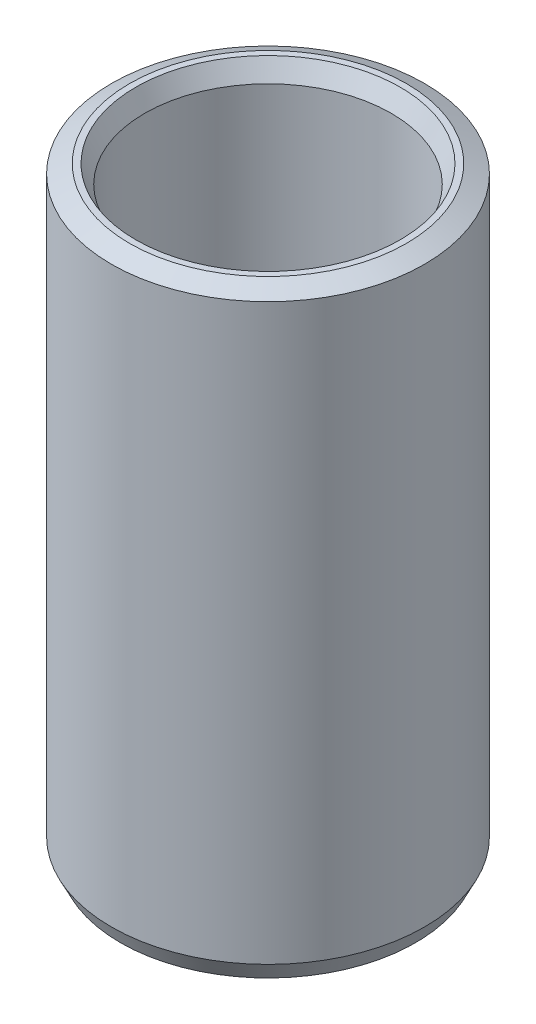
ISO-10303-21;
HEADER;
FILE_DESCRIPTION(('STEP AP214'),'2;1');
FILE_NAME('part.step','',(''),(''),'','','');
FILE_SCHEMA(('AUTOMOTIVE_DESIGN { 1 0 10303 214 1 1 1 1 }'));
ENDSEC;
DATA;
#1=APPLICATION_CONTEXT('core data for automotive mechanical design processes');
#2=APPLICATION_PROTOCOL_DEFINITION('international standard','automotive_design',2000,#1);
#3=PRODUCT_CONTEXT('',#1,'mechanical');
#4=PRODUCT('Part','Part','',(#3));
#5=PRODUCT_RELATED_PRODUCT_CATEGORY('part','',(#4));
#6=PRODUCT_DEFINITION_FORMATION('','',#4);
#7=PRODUCT_DEFINITION_CONTEXT('part definition',#1,'design');
#8=PRODUCT_DEFINITION('design','',#6,#7);
#9=PRODUCT_DEFINITION_SHAPE('','',#8);
#10=(LENGTH_UNIT() NAMED_UNIT(*) SI_UNIT(.MILLI.,.METRE.));
#11=(NAMED_UNIT(*) PLANE_ANGLE_UNIT() SI_UNIT($,.RADIAN.));
#12=(NAMED_UNIT(*) SI_UNIT($,.STERADIAN.) SOLID_ANGLE_UNIT());
#13=UNCERTAINTY_MEASURE_WITH_UNIT(LENGTH_MEASURE(1.E-05),#10,'distance_accuracy_value','');
#14=(GEOMETRIC_REPRESENTATION_CONTEXT(3) GLOBAL_UNCERTAINTY_ASSIGNED_CONTEXT((#13)) GLOBAL_UNIT_ASSIGNED_CONTEXT((#10,
#11,#12)) REPRESENTATION_CONTEXT('',''));
#15=CARTESIAN_POINT('',(0.,0.,0.));
#16=DIRECTION('',(0.,0.,1.));
#17=DIRECTION('',(1.,0.,0.));
#18=AXIS2_PLACEMENT_3D('',#15,#16,#17);
#19=CARTESIAN_POINT('',(0.,220.70376428403,0.));
#20=DIRECTION('',(0.,-1.,0.));
#21=DIRECTION('',(0.,0.,-1.));
#22=AXIS2_PLACEMENT_3D('',#19,#20,#21);
#23=CYLINDRICAL_SURFACE('',#22,57.5);
#24=CARTESIAN_POINT('',(0.,6.65723364518897,0.));
#25=DIRECTION('',(0.,1.,0.));
#26=DIRECTION('',(0.,0.,1.));
#27=AXIS2_PLACEMENT_3D('',#24,#25,#26);
#28=CIRCLE('',#27,57.5);
#29=CARTESIAN_POINT('',(0.,6.65723364518894,-57.5));
#30=VERTEX_POINT('',#29);
#31=EDGE_CURVE('E10',#30,#30,#28,.T.);
#32=CARTESIAN_POINT('',(0.,217.407283477707,0.));
#33=DIRECTION('',(0.,1.,0.));
#34=DIRECTION('',(0.,0.,1.));
#35=AXIS2_PLACEMENT_3D('',#32,#33,#34);
#36=CIRCLE('',#35,57.5);
#37=CARTESIAN_POINT('',(0.,217.407283477707,-57.5));
#38=VERTEX_POINT('',#37);
#39=EDGE_CURVE('E50',#38,#38,#36,.F.);
#40=CARTESIAN_POINT('',(0.,6.65723364518894,-57.5));
#41=CARTESIAN_POINT('',(0.,8.85254666427767,-57.5));
#42=CARTESIAN_POINT('',(0.,11.0478596833664,-57.5));
#43=CARTESIAN_POINT('',(0.,15.4384857215439,-57.5));
#44=CARTESIAN_POINT('',(0.,17.6337987406326,-57.5));
#45=CARTESIAN_POINT('',(0.,22.0244247788101,-57.5));
#46=CARTESIAN_POINT('',(0.,24.2197377978988,-57.5));
#47=CARTESIAN_POINT('',(0.,28.6103638360763,-57.5));
#48=CARTESIAN_POINT('',(0.,30.805676855165,-57.5));
#49=CARTESIAN_POINT('',(0.,35.1963028933424,-57.5));
#50=CARTESIAN_POINT('',(0.,37.3916159124312,-57.5));
#51=CARTESIAN_POINT('',(0.,41.7822419506086,-57.5));
#52=CARTESIAN_POINT('',(0.,43.9775549696974,-57.5));
#53=CARTESIAN_POINT('',(0.,48.3681810078748,-57.5));
#54=CARTESIAN_POINT('',(0.,50.5634940269636,-57.5));
#55=CARTESIAN_POINT('',(0.,54.954120065141,-57.5));
#56=CARTESIAN_POINT('',(0.,57.1494330842297,-57.5));
#57=CARTESIAN_POINT('',(0.,61.5400591224072,-57.5));
#58=CARTESIAN_POINT('',(0.,63.7353721414959,-57.5));
#59=CARTESIAN_POINT('',(0.,68.1259981796734,-57.5));
#60=CARTESIAN_POINT('',(0.,70.3213111987621,-57.5));
#61=CARTESIAN_POINT('',(0.,74.7119372369396,-57.5));
#62=CARTESIAN_POINT('',(0.,76.9072502560283,-57.5));
#63=CARTESIAN_POINT('',(0.,81.2978762942058,-57.5));
#64=CARTESIAN_POINT('',(0.,83.4931893132945,-57.5));
#65=CARTESIAN_POINT('',(0.,87.883815351472,-57.5));
#66=CARTESIAN_POINT('',(0.,90.0791283705607,-57.5));
#67=CARTESIAN_POINT('',(0.,94.4697544087381,-57.5));
#68=CARTESIAN_POINT('',(0.,96.6650674278269,-57.5));
#69=CARTESIAN_POINT('',(0.,101.055693466004,-57.5));
#70=CARTESIAN_POINT('',(0.,103.251006485093,-57.5));
#71=CARTESIAN_POINT('',(0.,107.641632523271,-57.5));
#72=CARTESIAN_POINT('',(0.,109.836945542359,-57.5));
#73=CARTESIAN_POINT('',(0.,114.227571580537,-57.5));
#74=CARTESIAN_POINT('',(0.,116.422884599625,-57.5));
#75=CARTESIAN_POINT('',(0.,120.813510637803,-57.5));
#76=CARTESIAN_POINT('',(0.,123.008823656892,-57.5));
#77=CARTESIAN_POINT('',(0.,127.399449695069,-57.5));
#78=CARTESIAN_POINT('',(0.,129.594762714158,-57.5));
#79=CARTESIAN_POINT('',(0.,133.985388752335,-57.5));
#80=CARTESIAN_POINT('',(0.,136.180701771424,-57.5));
#81=CARTESIAN_POINT('',(0.,140.571327809601,-57.5));
#82=CARTESIAN_POINT('',(0.,142.76664082869,-57.5));
#83=CARTESIAN_POINT('',(0.,147.157266866868,-57.5));
#84=CARTESIAN_POINT('',(0.,149.352579885956,-57.5));
#85=CARTESIAN_POINT('',(0.,153.743205924134,-57.5));
#86=CARTESIAN_POINT('',(0.,155.938518943223,-57.5));
#87=CARTESIAN_POINT('',(0.,160.3291449814,-57.5));
#88=CARTESIAN_POINT('',(0.,162.524458000489,-57.5));
#89=CARTESIAN_POINT('',(0.,166.915084038666,-57.5));
#90=CARTESIAN_POINT('',(0.,169.110397057755,-57.5));
#91=CARTESIAN_POINT('',(0.,173.501023095932,-57.5));
#92=CARTESIAN_POINT('',(0.,175.696336115021,-57.5));
#93=CARTESIAN_POINT('',(0.,180.086962153199,-57.5));
#94=CARTESIAN_POINT('',(0.,182.282275172287,-57.5));
#95=CARTESIAN_POINT('',(0.,186.672901210465,-57.5));
#96=CARTESIAN_POINT('',(0.,188.868214229554,-57.5));
#97=CARTESIAN_POINT('',(0.,193.258840267731,-57.5));
#98=CARTESIAN_POINT('',(0.,195.45415328682,-57.5));
#99=CARTESIAN_POINT('',(0.,199.844779324997,-57.5));
#100=CARTESIAN_POINT('',(0.,202.040092344086,-57.5));
#101=CARTESIAN_POINT('',(0.,206.430718382263,-57.5));
#102=CARTESIAN_POINT('',(0.,208.626031401352,-57.5));
#103=CARTESIAN_POINT('',(0.,213.01665743953,-57.5));
#104=CARTESIAN_POINT('',(0.,215.211970458618,-57.5));
#105=CARTESIAN_POINT('',(0.,217.407283477707,-57.5));
#106=B_SPLINE_CURVE_WITH_KNOTS('',3,(#40,#41,#42,#43,#44,#45,#46,#47,#48,#49,#50,#51,#52,#53,
#54,#55,#56,#57,#58,#59,#60,#61,#62,#63,#64,#65,#66,#67,#68,#69,#70,#71,#72,#73,#74,#75,#76,#77,
#78,#79,#80,#81,#82,#83,#84,#85,#86,#87,#88,#89,#90,#91,#92,#93,#94,#95,#96,#97,#98,#99,#100,
#101,#102,#103,#104,#105),.UNSPECIFIED.,.F.,.F.,(4,2,2,2,2,2,2,2,2,2,2,2,2,2,2,2,2,2,2,2,2,2,2,
2,2,2,2,2,2,2,2,2,4),(0.,6.58593905726618,13.1718781145324,19.7578171717986,26.3437562290648,
32.9296952863309,39.5156343435971,46.1015734008634,52.6875124581295,59.2734515153957,
65.8593905726619,72.4453296299281,79.0312686871943,85.6172077444605,92.2031468017267,
98.7890858589928,105.375024916259,111.960963973525,118.546903030791,125.132842088058,
131.718781145324,138.30472020259,144.890659259856,151.476598317122,158.062537374389,
164.648476431655,171.234415488921,177.820354546187,184.406293603453,190.992232660719,
197.578171717986,204.164110775252,210.750049832518),.UNSPECIFIED.);
#107=EDGE_CURVE('BSEAM39',#30,#38,#106,.T.);
#108=ORIENTED_EDGE('',*,*,#31,.T.);
#109=ORIENTED_EDGE('',*,*,#39,.T.);
#110=ORIENTED_EDGE('',*,*,#107,.T.);
#111=ORIENTED_EDGE('',*,*,#107,.F.);
#112=EDGE_LOOP('',(#108,#110,#109,#111));
#113=FACE_BOUND('',#112,.T.);
#114=ADVANCED_FACE('F39',(#113),#23,.T.);
#115=CARTESIAN_POINT('',(0.,220.70376428403,0.));
#116=DIRECTION('',(0.,1.,0.));
#117=DIRECTION('',(0.,0.,1.));
#118=AXIS2_PLACEMENT_3D('',#115,#116,#117);
#119=PLANE('',#118);
#120=CARTESIAN_POINT('',(0.,220.70376428403,0.));
#121=DIRECTION('',(0.,1.,0.));
#122=DIRECTION('',(0.,0.,1.));
#123=AXIS2_PLACEMENT_3D('',#120,#121,#122);
#124=CIRCLE('',#123,48.5578452740064);
#125=CARTESIAN_POINT('',(0.,220.70376428403,48.5578452740064));
#126=VERTEX_POINT('',#125);
#127=EDGE_CURVE('E58',#126,#126,#124,.F.);
#128=ORIENTED_EDGE('',*,*,#127,.T.);
#129=EDGE_LOOP('',(#128));
#130=FACE_BOUND('',#129,.T.);
#131=CARTESIAN_POINT('',(0.,220.70376428403,0.));
#132=DIRECTION('',(0.,1.,0.));
#133=DIRECTION('',(0.,0.,1.));
#134=AXIS2_PLACEMENT_3D('',#131,#132,#133);
#135=CIRCLE('',#134,50.8427663548114);
#136=CARTESIAN_POINT('',(0.,220.70376428403,-50.8427663548114));
#137=VERTEX_POINT('',#136);
#138=EDGE_CURVE('E61',#137,#137,#135,.T.);
#139=ORIENTED_EDGE('',*,*,#138,.T.);
#140=EDGE_LOOP('',(#139));
#141=FACE_BOUND('',#140,.T.);
#142=ADVANCED_FACE('F88',(#130,#141),#119,.T.);
#143=CARTESIAN_POINT('',(0.,0.,0.));
#144=DIRECTION('',(0.,1.,0.));
#145=DIRECTION('',(0.,0.,1.));
#146=AXIS2_PLACEMENT_3D('',#143,#144,#145);
#147=PLANE('',#146);
#148=CARTESIAN_POINT('',(0.,0.,0.));
#149=DIRECTION('',(0.,1.,0.));
#150=DIRECTION('',(0.,0.,1.));
#151=AXIS2_PLACEMENT_3D('',#148,#149,#150);
#152=CIRCLE('',#151,51.9185981128713);
#153=CARTESIAN_POINT('',(0.,0.,-51.9185981128713));
#154=VERTEX_POINT('',#153);
#155=EDGE_CURVE('E51',#154,#154,#152,.T.);
#156=ORIENTED_EDGE('',*,*,#155,.T.);
#157=EDGE_LOOP('',(#156));
#158=FACE_BOUND('',#157,.T.);
#159=CARTESIAN_POINT('',(0.,0.,0.));
#160=DIRECTION('',(0.,1.,0.));
#161=DIRECTION('',(0.,0.,1.));
#162=AXIS2_PLACEMENT_3D('',#159,#160,#161);
#163=CIRCLE('',#162,54.2035191936764);
#164=CARTESIAN_POINT('',(0.,0.,54.2035191936764));
#165=VERTEX_POINT('',#164);
#166=EDGE_CURVE('E54',#165,#165,#163,.F.);
#167=ORIENTED_EDGE('',*,*,#166,.T.);
#168=EDGE_LOOP('',(#167));
#169=FACE_BOUND('',#168,.T.);
#170=ADVANCED_FACE('F83',(#158,#169),#147,.F.);
#171=CARTESIAN_POINT('',(0.,220.70376428403,0.));
#172=DIRECTION('',(0.,-1.,0.));
#173=DIRECTION('',(0.,0.,-1.));
#174=AXIS2_PLACEMENT_3D('',#171,#172,#173);
#175=CYLINDRICAL_SURFACE('',#174,45.2613644676828);
#176=CARTESIAN_POINT('',(0.,214.046530638841,0.));
#177=DIRECTION('',(0.,1.,0.));
#178=DIRECTION('',(0.,0.,1.));
#179=AXIS2_PLACEMENT_3D('',#176,#177,#178);
#180=CIRCLE('',#179,45.2613644676828);
#181=CARTESIAN_POINT('',(0.,214.046530638841,-45.2613644676828));
#182=VERTEX_POINT('',#181);
#183=EDGE_CURVE('E67',#182,#182,#180,.T.);
#184=CARTESIAN_POINT('',(0.,3.29648080632339,0.));
#185=DIRECTION('',(0.,1.,0.));
#186=DIRECTION('',(0.,0.,1.));
#187=AXIS2_PLACEMENT_3D('',#184,#185,#186);
#188=CIRCLE('',#187,45.2613644676828);
#189=CARTESIAN_POINT('',(0.,3.29648080632339,-45.2613644676828));
#190=VERTEX_POINT('',#189);
#191=EDGE_CURVE('E69',#190,#190,#188,.F.);
#192=CARTESIAN_POINT('',(0.,214.046530638841,-45.2613644676828));
#193=CARTESIAN_POINT('',(0.,211.851217619753,-45.2613644676828));
#194=CARTESIAN_POINT('',(0.,209.655904600664,-45.2613644676828));
#195=CARTESIAN_POINT('',(0.,205.265278562487,-45.2613644676828));
#196=CARTESIAN_POINT('',(0.,203.069965543398,-45.2613644676828));
#197=CARTESIAN_POINT('',(0.,198.67933950522,-45.2613644676828));
#198=CARTESIAN_POINT('',(0.,196.484026486132,-45.2613644676828));
#199=CARTESIAN_POINT('',(0.,192.093400447954,-45.2613644676828));
#200=CARTESIAN_POINT('',(0.,189.898087428865,-45.2613644676828));
#201=CARTESIAN_POINT('',(0.,185.507461390688,-45.2613644676828));
#202=CARTESIAN_POINT('',(0.,183.312148371599,-45.2613644676828));
#203=CARTESIAN_POINT('',(0.,178.921522333422,-45.2613644676828));
#204=CARTESIAN_POINT('',(0.,176.726209314333,-45.2613644676828));
#205=CARTESIAN_POINT('',(0.,172.335583276156,-45.2613644676828));
#206=CARTESIAN_POINT('',(0.,170.140270257067,-45.2613644676828));
#207=CARTESIAN_POINT('',(0.,165.749644218889,-45.2613644676828));
#208=CARTESIAN_POINT('',(0.,163.554331199801,-45.2613644676828));
#209=CARTESIAN_POINT('',(0.,159.163705161623,-45.2613644676828));
#210=CARTESIAN_POINT('',(0.,156.968392142535,-45.2613644676828));
#211=CARTESIAN_POINT('',(0.,152.577766104357,-45.2613644676828));
#212=CARTESIAN_POINT('',(0.,150.382453085268,-45.2613644676828));
#213=CARTESIAN_POINT('',(0.,145.991827047091,-45.2613644676828));
#214=CARTESIAN_POINT('',(0.,143.796514028002,-45.2613644676828));
#215=CARTESIAN_POINT('',(0.,139.405887989825,-45.2613644676828));
#216=CARTESIAN_POINT('',(0.,137.210574970736,-45.2613644676828));
#217=CARTESIAN_POINT('',(0.,132.819948932558,-45.2613644676828));
#218=CARTESIAN_POINT('',(0.,130.62463591347,-45.2613644676828));
#219=CARTESIAN_POINT('',(0.,126.234009875292,-45.2613644676828));
#220=CARTESIAN_POINT('',(0.,124.038696856204,-45.2613644676828));
#221=CARTESIAN_POINT('',(0.,119.648070818026,-45.2613644676828));
#222=CARTESIAN_POINT('',(0.,117.452757798937,-45.2613644676828));
#223=CARTESIAN_POINT('',(0.,113.06213176076,-45.2613644676828));
#224=CARTESIAN_POINT('',(0.,110.866818741671,-45.2613644676828));
#225=CARTESIAN_POINT('',(0.,106.476192703494,-45.2613644676828));
#226=CARTESIAN_POINT('',(0.,104.280879684405,-45.2613644676828));
#227=CARTESIAN_POINT('',(0.,99.8902536462275,-45.2613644676828));
#228=CARTESIAN_POINT('',(0.,97.6949406271388,-45.2613644676828));
#229=CARTESIAN_POINT('',(0.,93.3043145889613,-45.2613644676828));
#230=CARTESIAN_POINT('',(0.,91.1090015698726,-45.2613644676828));
#231=CARTESIAN_POINT('',(0.,86.7183755316951,-45.2613644676828));
#232=CARTESIAN_POINT('',(0.,84.5230625126064,-45.2613644676828));
#233=CARTESIAN_POINT('',(0.,80.132436474429,-45.2613644676828));
#234=CARTESIAN_POINT('',(0.,77.9371234553402,-45.2613644676828));
#235=CARTESIAN_POINT('',(0.,73.5464974171628,-45.2613644676828));
#236=CARTESIAN_POINT('',(0.,71.351184398074,-45.2613644676828));
#237=CARTESIAN_POINT('',(0.,66.9605583598966,-45.2613644676828));
#238=CARTESIAN_POINT('',(0.,64.7652453408078,-45.2613644676828));
#239=CARTESIAN_POINT('',(0.,60.3746193026304,-45.2613644676828));
#240=CARTESIAN_POINT('',(0.,58.1793062835416,-45.2613644676828));
#241=CARTESIAN_POINT('',(0.,53.7886802453642,-45.2613644676828));
#242=CARTESIAN_POINT('',(0.,51.5933672262755,-45.2613644676828));
#243=CARTESIAN_POINT('',(0.,47.202741188098,-45.2613644676828));
#244=CARTESIAN_POINT('',(0.,45.0074281690093,-45.2613644676828));
#245=CARTESIAN_POINT('',(0.,40.6168021308318,-45.2613644676828));
#246=CARTESIAN_POINT('',(0.,38.4214891117431,-45.2613644676828));
#247=CARTESIAN_POINT('',(0.,34.0308630735656,-45.2613644676828));
#248=CARTESIAN_POINT('',(0.,31.8355500544769,-45.2613644676828));
#249=CARTESIAN_POINT('',(0.,27.4449240162994,-45.2613644676828));
#250=CARTESIAN_POINT('',(0.,25.2496109972107,-45.2613644676828));
#251=CARTESIAN_POINT('',(0.,20.8589849590332,-45.2613644676828));
#252=CARTESIAN_POINT('',(0.,18.6636719399445,-45.2613644676828));
#253=CARTESIAN_POINT('',(0.,14.273045901767,-45.2613644676828));
#254=CARTESIAN_POINT('',(0.,12.0777328826783,-45.2613644676828));
#255=CARTESIAN_POINT('',(0.,7.68710684450084,-45.2613644676828));
#256=CARTESIAN_POINT('',(0.,5.49179382541211,-45.2613644676828));
#257=CARTESIAN_POINT('',(0.,3.29648080632339,-45.2613644676828));
#258=B_SPLINE_CURVE_WITH_KNOTS('',3,(#192,#193,#194,#195,#196,#197,#198,#199,#200,#201,#202,
#203,#204,#205,#206,#207,#208,#209,#210,#211,#212,#213,#214,#215,#216,#217,#218,#219,#220,#221,
#222,#223,#224,#225,#226,#227,#228,#229,#230,#231,#232,#233,#234,#235,#236,#237,#238,#239,#240,
#241,#242,#243,#244,#245,#246,#247,#248,#249,#250,#251,#252,#253,#254,#255,#256,#257),
.UNSPECIFIED.,.F.,.F.,(4,2,2,2,2,2,2,2,2,2,2,2,2,2,2,2,2,2,2,2,2,2,2,2,2,2,2,2,2,2,2,2,4),(0.,
6.58593905726618,13.1718781145324,19.7578171717986,26.3437562290647,32.9296952863309,
39.5156343435971,46.1015734008633,52.6875124581295,59.2734515153957,65.8593905726619,
72.4453296299281,79.0312686871943,85.6172077444604,92.2031468017266,98.7890858589928,
105.375024916259,111.960963973525,118.546903030791,125.132842088058,131.718781145324,
138.30472020259,144.890659259856,151.476598317122,158.062537374389,164.648476431655,
171.234415488921,177.820354546187,184.406293603453,190.992232660719,197.578171717986,
204.164110775252,210.750049832518),.UNSPECIFIED.);
#259=EDGE_CURVE('BSEAM71',#182,#190,#258,.T.);
#260=ORIENTED_EDGE('',*,*,#183,.T.);
#261=ORIENTED_EDGE('',*,*,#191,.T.);
#262=ORIENTED_EDGE('',*,*,#259,.T.);
#263=ORIENTED_EDGE('',*,*,#259,.F.);
#264=EDGE_LOOP('',(#260,#262,#261,#263));
#265=FACE_BOUND('',#264,.T.);
#266=ADVANCED_FACE('F71',(#265),#175,.F.);
#267=CARTESIAN_POINT('',(0.,214.046530638841,0.));
#268=DIRECTION('',(0.,1.,0.));
#269=DIRECTION('',(0.,0.,1.));
#270=AXIS2_PLACEMENT_3D('',#267,#268,#269);
#271=CONICAL_SURFACE('',#270,45.2613644676828,0.459778370988112);
#272=ORIENTED_EDGE('',*,*,#127,.F.);
#273=EDGE_LOOP('',(#272));
#274=FACE_BOUND('',#273,.T.);
#275=ORIENTED_EDGE('',*,*,#183,.F.);
#276=EDGE_LOOP('',(#275));
#277=FACE_BOUND('',#276,.T.);
#278=ADVANCED_FACE('F77',(#274,#277),#271,.F.);
#279=CARTESIAN_POINT('',(0.,0.,0.));
#280=DIRECTION('',(0.,-1.,0.));
#281=DIRECTION('',(0.,0.,-1.));
#282=AXIS2_PLACEMENT_3D('',#279,#280,#281);
#283=CONICAL_SURFACE('',#282,51.9185981128713,1.11101795580677);
#284=CARTESIAN_POINT('',(0.,3.29648080632339,-45.2613644676828));
#285=CARTESIAN_POINT('',(0.,3.26214246459085,-45.3307106514869));
#286=CARTESIAN_POINT('',(0.,3.22780412285832,-45.4000568352909));
#287=CARTESIAN_POINT('',(0.,3.15912743939325,-45.538749202899));
#288=CARTESIAN_POINT('',(0.,3.12478909766071,-45.6080953867031));
#289=CARTESIAN_POINT('',(0.,3.05611241419564,-45.7467877543112));
#290=CARTESIAN_POINT('',(0.,3.02177407246311,-45.8161339381152));
#291=CARTESIAN_POINT('',(0.,2.95309738899803,-45.9548263057233));
#292=CARTESIAN_POINT('',(0.,2.9187590472655,-46.0241724895273));
#293=CARTESIAN_POINT('',(0.,2.85008236380043,-46.1628648571354));
#294=CARTESIAN_POINT('',(0.,2.81574402206789,-46.2322110409395));
#295=CARTESIAN_POINT('',(0.,2.74706733860282,-46.3709034085476));
#296=CARTESIAN_POINT('',(0.,2.71272899687029,-46.4402495923516));
#297=CARTESIAN_POINT('',(0.,2.64405231340522,-46.5789419599597));
#298=CARTESIAN_POINT('',(0.,2.60971397167268,-46.6482881437638));
#299=CARTESIAN_POINT('',(0.,2.54103728820761,-46.7869805113719));
#300=CARTESIAN_POINT('',(0.,2.50669894647508,-46.8563266951759));
#301=CARTESIAN_POINT('',(0.,2.43802226301,-46.995019062784));
#302=CARTESIAN_POINT('',(0.,2.40368392127747,-47.064365246588));
#303=CARTESIAN_POINT('',(0.,2.3350072378124,-47.2030576141961));
#304=CARTESIAN_POINT('',(0.,2.30066889607986,-47.2724037980002));
#305=CARTESIAN_POINT('',(0.,2.23199221261479,-47.4110961656083));
#306=CARTESIAN_POINT('',(0.,2.19765387088226,-47.4804423494123));
#307=CARTESIAN_POINT('',(0.,2.12897718741719,-47.6191347170204));
#308=CARTESIAN_POINT('',(0.,2.09463884568465,-47.6884809008245));
#309=CARTESIAN_POINT('',(0.,2.02596216221958,-47.8271732684326));
#310=CARTESIAN_POINT('',(0.,1.99162382048705,-47.8965194522366));
#311=CARTESIAN_POINT('',(0.,1.92294713702198,-48.0352118198447));
#312=CARTESIAN_POINT('',(0.,1.88860879528944,-48.1045580036487));
#313=CARTESIAN_POINT('',(0.,1.81993211182437,-48.2432503712568));
#314=CARTESIAN_POINT('',(0.,1.78559377009183,-48.3125965550609));
#315=CARTESIAN_POINT('',(0.,1.71691708662676,-48.451288922669));
#316=CARTESIAN_POINT('',(0.,1.68257874489423,-48.520635106473));
#317=CARTESIAN_POINT('',(0.,1.61390206142916,-48.6593274740811));
#318=CARTESIAN_POINT('',(0.,1.57956371969662,-48.7286736578852));
#319=CARTESIAN_POINT('',(0.,1.51088703623155,-48.8673660254933));
#320=CARTESIAN_POINT('',(0.,1.47654869449902,-48.9367122092973));
#321=CARTESIAN_POINT('',(0.,1.40787201103395,-49.0754045769054));
#322=CARTESIAN_POINT('',(0.,1.37353366930141,-49.1447507607095));
#323=CARTESIAN_POINT('',(0.,1.30485698583634,-49.2834431283176));
#324=CARTESIAN_POINT('',(0.,1.27051864410381,-49.3527893121216));
#325=CARTESIAN_POINT('',(0.,1.20184196063873,-49.4914816797297));
#326=CARTESIAN_POINT('',(0.,1.1675036189062,-49.5608278635337));
#327=CARTESIAN_POINT('',(0.,1.09882693544113,-49.6995202311418));
#328=CARTESIAN_POINT('',(0.,1.06448859370859,-49.7688664149459));
#329=CARTESIAN_POINT('',(0.,0.995811910243523,-49.907558782554));
#330=CARTESIAN_POINT('',(0.,0.961473568510988,-49.976904966358));
#331=CARTESIAN_POINT('',(0.,0.892796885045918,-50.1155973339661));
#332=CARTESIAN_POINT('',(0.,0.858458543313382,-50.1849435177702));
#333=CARTESIAN_POINT('',(0.,0.789781859848311,-50.3236358853783));
#334=CARTESIAN_POINT('',(0.,0.755443518115776,-50.3929820691823));
#335=CARTESIAN_POINT('',(0.,0.686766834650705,-50.5316744367904));
#336=CARTESIAN_POINT('',(0.,0.652428492918171,-50.6010206205944));
#337=CARTESIAN_POINT('',(0.,0.5837518094531,-50.7397129882025));
#338=CARTESIAN_POINT('',(0.,0.549413467720565,-50.8090591720066));
#339=CARTESIAN_POINT('',(0.,0.480736784255494,-50.9477515396147));
#340=CARTESIAN_POINT('',(0.,0.446398442522959,-51.0170977234187));
#341=CARTESIAN_POINT('',(0.,0.377721759057888,-51.1557900910268));
#342=CARTESIAN_POINT('',(0.,0.343383417325353,-51.2251362748309));
#343=CARTESIAN_POINT('',(0.,0.274706733860282,-51.3638286424389));
#344=CARTESIAN_POINT('',(0.,0.240368392127746,-51.433174826243));
#345=CARTESIAN_POINT('',(0.,0.171691708662676,-51.5718671938511));
#346=CARTESIAN_POINT('',(0.,0.137353366930141,-51.6412133776551));
#347=CARTESIAN_POINT('',(0.,0.0686766834650715,-51.7799057452632));
#348=CARTESIAN_POINT('',(0.,0.0343383417325367,-51.8492519290673));
#349=CARTESIAN_POINT('',(0.,0.,-51.9185981128713));
#350=B_SPLINE_CURVE_WITH_KNOTS('',3,(#284,#285,#286,#287,#288,#289,#290,#291,#292,#293,#294,
#295,#296,#297,#298,#299,#300,#301,#302,#303,#304,#305,#306,#307,#308,#309,#310,#311,#312,#313,
#314,#315,#316,#317,#318,#319,#320,#321,#322,#323,#324,#325,#326,#327,#328,#329,#330,#331,#332,
#333,#334,#335,#336,#337,#338,#339,#340,#341,#342,#343,#344,#345,#346,#347,#348,#349),
.UNSPECIFIED.,.F.,.F.,(4,2,2,2,2,2,2,2,2,2,2,2,2,2,2,2,2,2,2,2,2,2,2,2,2,2,2,2,2,2,2,2,4),(0.,
0.23214679470138,0.464293589402765,0.696440384104145,0.928587178805525,1.1607339735069,
1.39288076820828,1.62502756290967,1.85717435761105,2.08932115231243,2.32146794701382,
2.5536147417152,2.78576153641657,3.01790833111795,3.25005512581933,3.48220192052072,
3.7143487152221,3.94649550992348,4.17864230462486,4.41078909932624,4.64293589402762,
4.875082688729,5.10722948343038,5.33937627813177,5.57152307283315,5.80366986753453,
6.03581666223591,6.26796345693729,6.50011025163867,6.73225704634005,6.96440384104143,
7.19655063574282,7.4286974304442),.UNSPECIFIED.);
#351=EDGE_CURVE('BSEAM73',#190,#154,#350,.T.);
#352=ORIENTED_EDGE('',*,*,#191,.F.);
#353=ORIENTED_EDGE('',*,*,#155,.F.);
#354=ORIENTED_EDGE('',*,*,#351,.T.);
#355=ORIENTED_EDGE('',*,*,#351,.F.);
#356=EDGE_LOOP('',(#352,#354,#353,#355));
#357=FACE_BOUND('',#356,.T.);
#358=ADVANCED_FACE('F73',(#357),#283,.F.);
#359=CARTESIAN_POINT('',(0.,6.65723364518897,0.));
#360=DIRECTION('',(0.,1.,0.));
#361=DIRECTION('',(0.,0.,1.));
#362=AXIS2_PLACEMENT_3D('',#359,#360,#361);
#363=CONICAL_SURFACE('',#362,57.5,0.459778370988119);
#364=ORIENTED_EDGE('',*,*,#166,.F.);
#365=EDGE_LOOP('',(#364));
#366=FACE_BOUND('',#365,.T.);
#367=ORIENTED_EDGE('',*,*,#31,.F.);
#368=EDGE_LOOP('',(#367));
#369=FACE_BOUND('',#368,.T.);
#370=ADVANCED_FACE('F76',(#366,#369),#363,.T.);
#371=CARTESIAN_POINT('',(0.,220.70376428403,0.));
#372=DIRECTION('',(0.,-1.,0.));
#373=DIRECTION('',(0.,0.,-1.));
#374=AXIS2_PLACEMENT_3D('',#371,#372,#373);
#375=CONICAL_SURFACE('',#374,50.8427663548114,1.11101795580678);
#376=CARTESIAN_POINT('',(0.,217.407283477707,-57.5));
#377=CARTESIAN_POINT('',(0.,217.44162181944,-57.430653816196));
#378=CARTESIAN_POINT('',(0.,217.475960161172,-57.3613076323919));
#379=CARTESIAN_POINT('',(0.,217.544636844637,-57.2226152647838));
#380=CARTESIAN_POINT('',(0.,217.57897518637,-57.1532690809798));
#381=CARTESIAN_POINT('',(0.,217.647651869835,-57.0145767133717));
#382=CARTESIAN_POINT('',(0.,217.681990211567,-56.9452305295676));
#383=CARTESIAN_POINT('',(0.,217.750666895032,-56.8065381619596));
#384=CARTESIAN_POINT('',(0.,217.785005236765,-56.7371919781555));
#385=CARTESIAN_POINT('',(0.,217.85368192023,-56.5984996105474));
#386=CARTESIAN_POINT('',(0.,217.888020261963,-56.5291534267434));
#387=CARTESIAN_POINT('',(0.,217.956696945428,-56.3904610591353));
#388=CARTESIAN_POINT('',(0.,217.99103528716,-56.3211148753312));
#389=CARTESIAN_POINT('',(0.,218.059711970625,-56.1824225077231));
#390=CARTESIAN_POINT('',(0.,218.094050312358,-56.1130763239191));
#391=CARTESIAN_POINT('',(0.,218.162726995823,-55.974383956311));
#392=CARTESIAN_POINT('',(0.,218.197065337555,-55.9050377725069));
#393=CARTESIAN_POINT('',(0.,218.26574202102,-55.7663454048988));
#394=CARTESIAN_POINT('',(0.,218.300080362753,-55.6969992210948));
#395=CARTESIAN_POINT('',(0.,218.368757046218,-55.5583068534867));
#396=CARTESIAN_POINT('',(0.,218.403095387951,-55.4889606696826));
#397=CARTESIAN_POINT('',(0.,218.471772071416,-55.3502683020745));
#398=CARTESIAN_POINT('',(0.,218.506110413148,-55.2809221182705));
#399=CARTESIAN_POINT('',(0.,218.574787096613,-55.1422297506624));
#400=CARTESIAN_POINT('',(0.,218.609125438346,-55.0728835668583));
#401=CARTESIAN_POINT('',(0.,218.677802121811,-54.9341911992503));
#402=CARTESIAN_POINT('',(0.,218.712140463543,-54.8648450154462));
#403=CARTESIAN_POINT('',(0.,218.780817147008,-54.7261526478381));
#404=CARTESIAN_POINT('',(0.,218.815155488741,-54.6568064640341));
#405=CARTESIAN_POINT('',(0.,218.883832172206,-54.518114096426));
#406=CARTESIAN_POINT('',(0.,218.918170513939,-54.4487679126219));
#407=CARTESIAN_POINT('',(0.,218.986847197404,-54.3100755450138));
#408=CARTESIAN_POINT('',(0.,219.021185539136,-54.2407293612098));
#409=CARTESIAN_POINT('',(0.,219.089862222601,-54.1020369936017));
#410=CARTESIAN_POINT('',(0.,219.124200564334,-54.0326908097976));
#411=CARTESIAN_POINT('',(0.,219.192877247799,-53.8939984421895));
#412=CARTESIAN_POINT('',(0.,219.227215589531,-53.8246522583855));
#413=CARTESIAN_POINT('',(0.,219.295892272996,-53.6859598907774));
#414=CARTESIAN_POINT('',(0.,219.330230614729,-53.6166137069733));
#415=CARTESIAN_POINT('',(0.,219.398907298194,-53.4779213393652));
#416=CARTESIAN_POINT('',(0.,219.433245639927,-53.4085751555612));
#417=CARTESIAN_POINT('',(0.,219.501922323392,-53.2698827879531));
#418=CARTESIAN_POINT('',(0.,219.536260665124,-53.200536604149));
#419=CARTESIAN_POINT('',(0.,219.604937348589,-53.0618442365409));
#420=CARTESIAN_POINT('',(0.,219.639275690322,-52.9924980527369));
#421=CARTESIAN_POINT('',(0.,219.707952373787,-52.8538056851288));
#422=CARTESIAN_POINT('',(0.,219.742290715519,-52.7844595013248));
#423=CARTESIAN_POINT('',(0.,219.810967398985,-52.6457671337167));
#424=CARTESIAN_POINT('',(0.,219.845305740717,-52.5764209499126));
#425=CARTESIAN_POINT('',(0.,219.913982424182,-52.4377285823045));
#426=CARTESIAN_POINT('',(0.,219.948320765915,-52.3683823985005));
#427=CARTESIAN_POINT('',(0.,220.01699744938,-52.2296900308924));
#428=CARTESIAN_POINT('',(0.,220.051335791112,-52.1603438470883));
#429=CARTESIAN_POINT('',(0.,220.120012474577,-52.0216514794802));
#430=CARTESIAN_POINT('',(0.,220.15435081631,-51.9523052956762));
#431=CARTESIAN_POINT('',(0.,220.223027499775,-51.8136129280681));
#432=CARTESIAN_POINT('',(0.,220.257365841507,-51.744266744264));
#433=CARTESIAN_POINT('',(0.,220.326042524973,-51.6055743766559));
#434=CARTESIAN_POINT('',(0.,220.360380866705,-51.5362281928519));
#435=CARTESIAN_POINT('',(0.,220.42905755017,-51.3975358252438));
#436=CARTESIAN_POINT('',(0.,220.463395891903,-51.3281896414397));
#437=CARTESIAN_POINT('',(0.,220.532072575368,-51.1894972738317));
#438=CARTESIAN_POINT('',(0.,220.5664109171,-51.1201510900276));
#439=CARTESIAN_POINT('',(0.,220.635087600565,-50.9814587224195));
#440=CARTESIAN_POINT('',(0.,220.669425942298,-50.9121125386155));
#441=CARTESIAN_POINT('',(0.,220.70376428403,-50.8427663548114));
#442=B_SPLINE_CURVE_WITH_KNOTS('',3,(#376,#377,#378,#379,#380,#381,#382,#383,#384,#385,#386,
#387,#388,#389,#390,#391,#392,#393,#394,#395,#396,#397,#398,#399,#400,#401,#402,#403,#404,#405,
#406,#407,#408,#409,#410,#411,#412,#413,#414,#415,#416,#417,#418,#419,#420,#421,#422,#423,#424,
#425,#426,#427,#428,#429,#430,#431,#432,#433,#434,#435,#436,#437,#438,#439,#440,#441),
.UNSPECIFIED.,.F.,.F.,(4,2,2,2,2,2,2,2,2,2,2,2,2,2,2,2,2,2,2,2,2,2,2,2,2,2,2,2,2,2,2,2,4),(0.,
0.232146794701392,0.464293589402778,0.696440384104164,0.92858717880555,1.16073397350694,
1.39288076820832,1.6250275629097,1.85717435761109,2.08932115231247,2.32146794701386,
2.55361474171524,2.78576153641663,3.01790833111801,3.2500551258194,3.48220192052078,
3.71434871522217,3.94649550992355,4.17864230462493,4.41078909932632,4.6429358940277,
4.87508268872909,5.10722948343048,5.33937627813186,5.57152307283324,5.80366986753463,
6.03581666223601,6.2679634569374,6.50011025163879,6.73225704634017,6.96440384104155,
7.19655063574294,7.42869743044434),.UNSPECIFIED.);
#443=EDGE_CURVE('BSEAM45',#38,#137,#442,.T.);
#444=ORIENTED_EDGE('',*,*,#39,.F.);
#445=ORIENTED_EDGE('',*,*,#138,.F.);
#446=ORIENTED_EDGE('',*,*,#443,.T.);
#447=ORIENTED_EDGE('',*,*,#443,.F.);
#448=EDGE_LOOP('',(#444,#446,#445,#447));
#449=FACE_BOUND('',#448,.T.);
#450=ADVANCED_FACE('F45',(#449),#375,.T.);
#451=CLOSED_SHELL('',(#114,#142,#170,#266,#278,#358,#370,#450));
#452=MANIFOLD_SOLID_BREP('B2',#451);
#453=ADVANCED_BREP_SHAPE_REPRESENTATION('',(#18,#452),#14);
#454=SHAPE_DEFINITION_REPRESENTATION(#9,#453);
ENDSEC;
END-ISO-10303-21;
